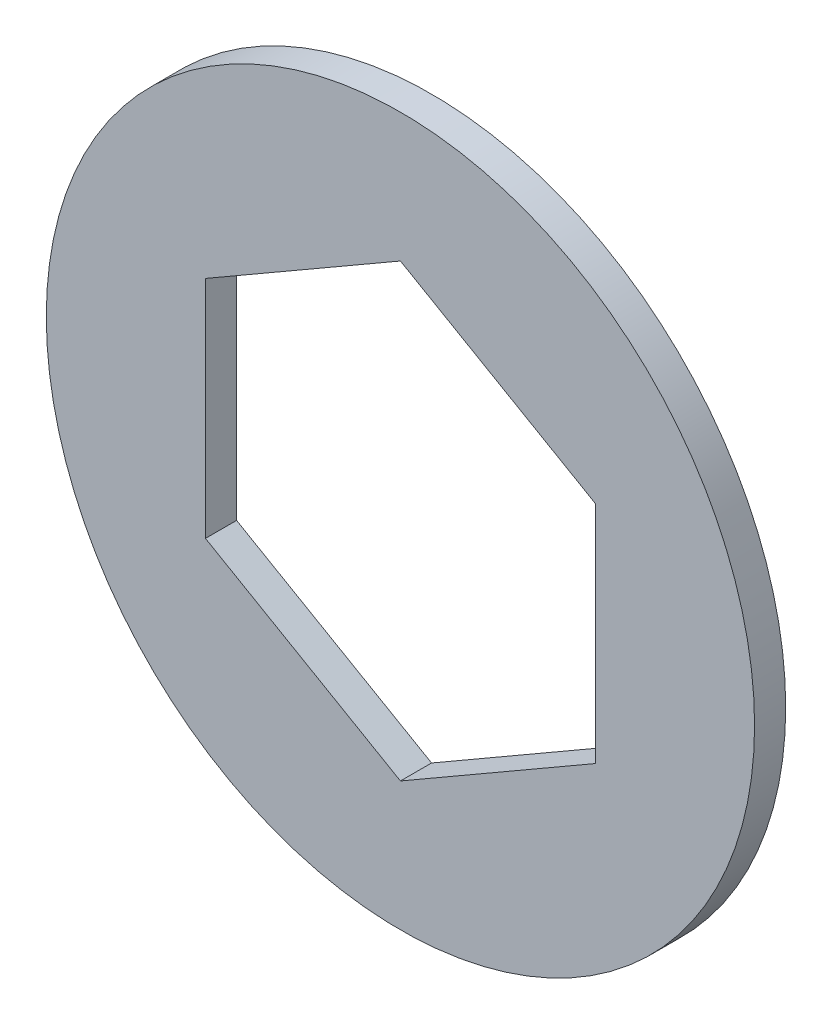
ISO-10303-21;
HEADER;
FILE_DESCRIPTION(('STEP AP214'),'2;1');
FILE_NAME('part.step','',(''),(''),'','','');
FILE_SCHEMA(('AUTOMOTIVE_DESIGN { 1 0 10303 214 1 1 1 1 }'));
ENDSEC;
DATA;
#1=APPLICATION_CONTEXT('core data for automotive mechanical design processes');
#2=APPLICATION_PROTOCOL_DEFINITION('international standard','automotive_design',2000,#1);
#3=PRODUCT_CONTEXT('',#1,'mechanical');
#4=PRODUCT('Part','Part','',(#3));
#5=PRODUCT_RELATED_PRODUCT_CATEGORY('part','',(#4));
#6=PRODUCT_DEFINITION_FORMATION('','',#4);
#7=PRODUCT_DEFINITION_CONTEXT('part definition',#1,'design');
#8=PRODUCT_DEFINITION('design','',#6,#7);
#9=PRODUCT_DEFINITION_SHAPE('','',#8);
#10=(LENGTH_UNIT() NAMED_UNIT(*) SI_UNIT(.MILLI.,.METRE.));
#11=(NAMED_UNIT(*) PLANE_ANGLE_UNIT() SI_UNIT($,.RADIAN.));
#12=(NAMED_UNIT(*) SI_UNIT($,.STERADIAN.) SOLID_ANGLE_UNIT());
#13=UNCERTAINTY_MEASURE_WITH_UNIT(LENGTH_MEASURE(1.E-05),#10,'distance_accuracy_value','');
#14=(GEOMETRIC_REPRESENTATION_CONTEXT(3) GLOBAL_UNCERTAINTY_ASSIGNED_CONTEXT((#13)) GLOBAL_UNIT_ASSIGNED_CONTEXT((#10,
#11,#12)) REPRESENTATION_CONTEXT('',''));
#15=CARTESIAN_POINT('',(0.,0.,0.));
#16=DIRECTION('',(0.,0.,1.));
#17=DIRECTION('',(1.,0.,0.));
#18=AXIS2_PLACEMENT_3D('',#15,#16,#17);
#19=CARTESIAN_POINT('',(0.,0.,4.));
#20=DIRECTION('',(0.,0.,1.));
#21=DIRECTION('',(1.,0.,0.));
#22=AXIS2_PLACEMENT_3D('',#19,#20,#21);
#23=PLANE('',#22);
#24=CARTESIAN_POINT('',(0.,0.,4.));
#25=DIRECTION('',(0.,0.,1.));
#26=DIRECTION('',(1.,0.,0.));
#27=AXIS2_PLACEMENT_3D('',#24,#25,#26);
#28=CIRCLE('',#27,45.5);
#29=CARTESIAN_POINT('',(45.5,0.,4.));
#30=VERTEX_POINT('',#29);
#31=EDGE_CURVE('E11',#30,#30,#28,.T.);
#32=ORIENTED_EDGE('',*,*,#31,.T.);
#33=EDGE_LOOP('',(#32));
#34=FACE_BOUND('',#33,.T.);
#35=DIRECTION('',(-0.866025403784439,-0.5,0.));
#36=VECTOR('',#35,1.);
#37=CARTESIAN_POINT('',(0.,28.9252484864003,4.));
#38=LINE('',#37,#36);
#39=CARTESIAN_POINT('',(0.,28.9252484864003,4.));
#40=VERTEX_POINT('',#39);
#41=CARTESIAN_POINT('',(-25.05,14.4626242432001,4.));
#42=VERTEX_POINT('',#41);
#43=EDGE_CURVE('E94',#40,#42,#38,.T.);
#44=ORIENTED_EDGE('',*,*,#43,.F.);
#45=DIRECTION('',(-0.866025403784439,0.5,0.));
#46=VECTOR('',#45,1.);
#47=CARTESIAN_POINT('',(25.05,14.4626242432001,4.));
#48=LINE('',#47,#46);
#49=CARTESIAN_POINT('',(25.05,14.4626242432001,4.));
#50=VERTEX_POINT('',#49);
#51=EDGE_CURVE('E86',#50,#40,#48,.T.);
#52=ORIENTED_EDGE('',*,*,#51,.F.);
#53=DIRECTION('',(0.,1.,0.));
#54=VECTOR('',#53,1.);
#55=CARTESIAN_POINT('',(25.05,-14.4626242432001,4.));
#56=LINE('',#55,#54);
#57=CARTESIAN_POINT('',(25.05,-14.4626242432001,4.));
#58=VERTEX_POINT('',#57);
#59=EDGE_CURVE('E114',#58,#50,#56,.T.);
#60=ORIENTED_EDGE('',*,*,#59,.F.);
#61=DIRECTION('',(0.866025403784439,0.5,0.));
#62=VECTOR('',#61,1.);
#63=CARTESIAN_POINT('',(0.,-28.9252484864002,4.));
#64=LINE('',#63,#62);
#65=CARTESIAN_POINT('',(0.,-28.9252484864002,4.));
#66=VERTEX_POINT('',#65);
#67=EDGE_CURVE('E112',#66,#58,#64,.T.);
#68=ORIENTED_EDGE('',*,*,#67,.F.);
#69=DIRECTION('',(0.866025403784439,-0.5,0.));
#70=VECTOR('',#69,1.);
#71=CARTESIAN_POINT('',(-25.05,-14.4626242432001,4.));
#72=LINE('',#71,#70);
#73=CARTESIAN_POINT('',(-25.05,-14.4626242432001,4.));
#74=VERTEX_POINT('',#73);
#75=EDGE_CURVE('E108',#74,#66,#72,.T.);
#76=ORIENTED_EDGE('',*,*,#75,.F.);
#77=DIRECTION('',(0.,-1.,0.));
#78=VECTOR('',#77,1.);
#79=CARTESIAN_POINT('',(-25.05,14.4626242432001,4.));
#80=LINE('',#79,#78);
#81=EDGE_CURVE('E106',#42,#74,#80,.T.);
#82=ORIENTED_EDGE('',*,*,#81,.F.);
#83=EDGE_LOOP('',(#44,#52,#60,#68,#76,#82));
#84=FACE_BOUND('',#83,.T.);
#85=ADVANCED_FACE('F33',(#34,#84),#23,.T.);
#86=CARTESIAN_POINT('',(0.,0.,0.));
#87=DIRECTION('',(0.,0.,1.));
#88=DIRECTION('',(1.,0.,0.));
#89=AXIS2_PLACEMENT_3D('',#86,#87,#88);
#90=PLANE('',#89);
#91=CARTESIAN_POINT('',(0.,0.,0.));
#92=DIRECTION('',(0.,0.,1.));
#93=DIRECTION('',(1.,0.,0.));
#94=AXIS2_PLACEMENT_3D('',#91,#92,#93);
#95=CIRCLE('',#94,45.5);
#96=CARTESIAN_POINT('',(45.5,0.,0.));
#97=VERTEX_POINT('',#96);
#98=EDGE_CURVE('E37',#97,#97,#95,.T.);
#99=ORIENTED_EDGE('',*,*,#98,.F.);
#100=EDGE_LOOP('',(#99));
#101=FACE_BOUND('',#100,.T.);
#102=DIRECTION('',(-0.866025403784439,0.5,0.));
#103=VECTOR('',#102,1.);
#104=CARTESIAN_POINT('',(25.05,14.4626242432001,0.));
#105=LINE('',#104,#103);
#106=CARTESIAN_POINT('',(25.05,14.4626242432001,0.));
#107=VERTEX_POINT('',#106);
#108=CARTESIAN_POINT('',(0.,28.9252484864003,0.));
#109=VERTEX_POINT('',#108);
#110=EDGE_CURVE('E56',#107,#109,#105,.T.);
#111=ORIENTED_EDGE('',*,*,#110,.T.);
#112=DIRECTION('',(-0.866025403784439,-0.5,0.));
#113=VECTOR('',#112,1.);
#114=CARTESIAN_POINT('',(0.,28.9252484864003,0.));
#115=LINE('',#114,#113);
#116=CARTESIAN_POINT('',(-25.05,14.4626242432001,0.));
#117=VERTEX_POINT('',#116);
#118=EDGE_CURVE('E101',#109,#117,#115,.T.);
#119=ORIENTED_EDGE('',*,*,#118,.T.);
#120=DIRECTION('',(0.,-1.,0.));
#121=VECTOR('',#120,1.);
#122=CARTESIAN_POINT('',(-25.05,14.4626242432001,0.));
#123=LINE('',#122,#121);
#124=CARTESIAN_POINT('',(-25.05,-14.4626242432001,0.));
#125=VERTEX_POINT('',#124);
#126=EDGE_CURVE('E118',#117,#125,#123,.T.);
#127=ORIENTED_EDGE('',*,*,#126,.T.);
#128=DIRECTION('',(0.866025403784439,-0.5,0.));
#129=VECTOR('',#128,1.);
#130=CARTESIAN_POINT('',(-25.05,-14.4626242432001,0.));
#131=LINE('',#130,#129);
#132=CARTESIAN_POINT('',(0.,-28.9252484864002,0.));
#133=VERTEX_POINT('',#132);
#134=EDGE_CURVE('E121',#125,#133,#131,.T.);
#135=ORIENTED_EDGE('',*,*,#134,.T.);
#136=DIRECTION('',(0.866025403784439,0.5,0.));
#137=VECTOR('',#136,1.);
#138=CARTESIAN_POINT('',(0.,-28.9252484864002,0.));
#139=LINE('',#138,#137);
#140=CARTESIAN_POINT('',(25.05,-14.4626242432001,0.));
#141=VERTEX_POINT('',#140);
#142=EDGE_CURVE('E124',#133,#141,#139,.T.);
#143=ORIENTED_EDGE('',*,*,#142,.T.);
#144=DIRECTION('',(0.,1.,0.));
#145=VECTOR('',#144,1.);
#146=CARTESIAN_POINT('',(25.05,-14.4626242432001,0.));
#147=LINE('',#146,#145);
#148=EDGE_CURVE('E95',#141,#107,#147,.T.);
#149=ORIENTED_EDGE('',*,*,#148,.T.);
#150=EDGE_LOOP('',(#111,#119,#127,#135,#143,#149));
#151=FACE_BOUND('',#150,.T.);
#152=ADVANCED_FACE('F141',(#101,#151),#90,.F.);
#153=CARTESIAN_POINT('',(0.,0.,4.));
#154=DIRECTION('',(0.,0.,-1.));
#155=DIRECTION('',(-1.,0.,0.));
#156=AXIS2_PLACEMENT_3D('',#153,#154,#155);
#157=CYLINDRICAL_SURFACE('',#156,45.5);
#158=ORIENTED_EDGE('',*,*,#31,.F.);
#159=EDGE_LOOP('',(#158));
#160=FACE_BOUND('',#159,.T.);
#161=ORIENTED_EDGE('',*,*,#98,.T.);
#162=EDGE_LOOP('',(#161));
#163=FACE_BOUND('',#162,.T.);
#164=ADVANCED_FACE('F35',(#160,#163),#157,.T.);
#165=CARTESIAN_POINT('',(25.05,14.4626242432001,4.));
#166=DIRECTION('',(-0.5,-0.866025403784439,0.));
#167=DIRECTION('',(0.866025403784439,-0.5,0.));
#168=AXIS2_PLACEMENT_3D('',#165,#166,#167);
#169=PLANE('',#168);
#170=ORIENTED_EDGE('',*,*,#110,.F.);
#171=DIRECTION('',(0.,0.,-1.));
#172=VECTOR('',#171,1.);
#173=CARTESIAN_POINT('',(25.05,14.4626242432001,4.));
#174=LINE('',#173,#172);
#175=EDGE_CURVE('E90',#50,#107,#174,.T.);
#176=ORIENTED_EDGE('',*,*,#175,.F.);
#177=ORIENTED_EDGE('',*,*,#51,.T.);
#178=DIRECTION('',(0.,0.,-1.));
#179=VECTOR('',#178,1.);
#180=CARTESIAN_POINT('',(0.,28.9252484864003,4.));
#181=LINE('',#180,#179);
#182=EDGE_CURVE('E89',#40,#109,#181,.T.);
#183=ORIENTED_EDGE('',*,*,#182,.T.);
#184=EDGE_LOOP('',(#170,#176,#177,#183));
#185=FACE_BOUND('',#184,.T.);
#186=ADVANCED_FACE('F88',(#185),#169,.T.);
#187=CARTESIAN_POINT('',(0.,28.9252484864003,4.));
#188=DIRECTION('',(0.5,-0.866025403784438,0.));
#189=DIRECTION('',(0.866025403784439,0.5,0.));
#190=AXIS2_PLACEMENT_3D('',#187,#188,#189);
#191=PLANE('',#190);
#192=ORIENTED_EDGE('',*,*,#118,.F.);
#193=ORIENTED_EDGE('',*,*,#182,.F.);
#194=ORIENTED_EDGE('',*,*,#43,.T.);
#195=DIRECTION('',(0.,0.,-1.));
#196=VECTOR('',#195,1.);
#197=CARTESIAN_POINT('',(-25.05,14.4626242432001,4.));
#198=LINE('',#197,#196);
#199=EDGE_CURVE('E102',#42,#117,#198,.T.);
#200=ORIENTED_EDGE('',*,*,#199,.T.);
#201=EDGE_LOOP('',(#192,#193,#194,#200));
#202=FACE_BOUND('',#201,.T.);
#203=ADVANCED_FACE('F98',(#202),#191,.T.);
#204=CARTESIAN_POINT('',(-25.05,14.4626242432001,4.));
#205=DIRECTION('',(1.,0.,0.));
#206=DIRECTION('',(0.,0.,-1.));
#207=AXIS2_PLACEMENT_3D('',#204,#205,#206);
#208=PLANE('',#207);
#209=ORIENTED_EDGE('',*,*,#126,.F.);
#210=ORIENTED_EDGE('',*,*,#199,.F.);
#211=ORIENTED_EDGE('',*,*,#81,.T.);
#212=DIRECTION('',(0.,0.,-1.));
#213=VECTOR('',#212,1.);
#214=CARTESIAN_POINT('',(-25.05,-14.4626242432001,4.));
#215=LINE('',#214,#213);
#216=EDGE_CURVE('E133',#74,#125,#215,.T.);
#217=ORIENTED_EDGE('',*,*,#216,.T.);
#218=EDGE_LOOP('',(#209,#210,#211,#217));
#219=FACE_BOUND('',#218,.T.);
#220=ADVANCED_FACE('F137',(#219),#208,.T.);
#221=CARTESIAN_POINT('',(-25.05,-14.4626242432001,4.));
#222=DIRECTION('',(0.5,0.866025403784439,0.));
#223=DIRECTION('',(-0.866025403784439,0.5,0.));
#224=AXIS2_PLACEMENT_3D('',#221,#222,#223);
#225=PLANE('',#224);
#226=ORIENTED_EDGE('',*,*,#134,.F.);
#227=ORIENTED_EDGE('',*,*,#216,.F.);
#228=ORIENTED_EDGE('',*,*,#75,.T.);
#229=DIRECTION('',(0.,0.,-1.));
#230=VECTOR('',#229,1.);
#231=CARTESIAN_POINT('',(0.,-28.9252484864002,4.));
#232=LINE('',#231,#230);
#233=EDGE_CURVE('E131',#66,#133,#232,.T.);
#234=ORIENTED_EDGE('',*,*,#233,.T.);
#235=EDGE_LOOP('',(#226,#227,#228,#234));
#236=FACE_BOUND('',#235,.T.);
#237=ADVANCED_FACE('F149',(#236),#225,.T.);
#238=CARTESIAN_POINT('',(0.,-28.9252484864002,4.));
#239=DIRECTION('',(-0.5,0.866025403784439,0.));
#240=DIRECTION('',(-0.866025403784439,-0.5,0.));
#241=AXIS2_PLACEMENT_3D('',#238,#239,#240);
#242=PLANE('',#241);
#243=ORIENTED_EDGE('',*,*,#142,.F.);
#244=ORIENTED_EDGE('',*,*,#233,.F.);
#245=ORIENTED_EDGE('',*,*,#67,.T.);
#246=DIRECTION('',(0.,0.,-1.));
#247=VECTOR('',#246,1.);
#248=CARTESIAN_POINT('',(25.05,-14.4626242432001,4.));
#249=LINE('',#248,#247);
#250=EDGE_CURVE('E48',#58,#141,#249,.T.);
#251=ORIENTED_EDGE('',*,*,#250,.T.);
#252=EDGE_LOOP('',(#243,#244,#245,#251));
#253=FACE_BOUND('',#252,.T.);
#254=ADVANCED_FACE('F147',(#253),#242,.T.);
#255=CARTESIAN_POINT('',(25.05,-14.4626242432001,4.));
#256=DIRECTION('',(-1.,0.,0.));
#257=DIRECTION('',(0.,-1.,0.));
#258=AXIS2_PLACEMENT_3D('',#255,#256,#257);
#259=PLANE('',#258);
#260=ORIENTED_EDGE('',*,*,#148,.F.);
#261=ORIENTED_EDGE('',*,*,#250,.F.);
#262=ORIENTED_EDGE('',*,*,#59,.T.);
#263=ORIENTED_EDGE('',*,*,#175,.T.);
#264=EDGE_LOOP('',(#260,#261,#262,#263));
#265=FACE_BOUND('',#264,.T.);
#266=ADVANCED_FACE('F143',(#265),#259,.T.);
#267=CLOSED_SHELL('',(#85,#152,#164,#186,#203,#220,#237,#254,#266));
#268=MANIFOLD_SOLID_BREP('B2',#267);
#269=ADVANCED_BREP_SHAPE_REPRESENTATION('',(#18,#268),#14);
#270=SHAPE_DEFINITION_REPRESENTATION(#9,#269);
ENDSEC;
END-ISO-10303-21;
